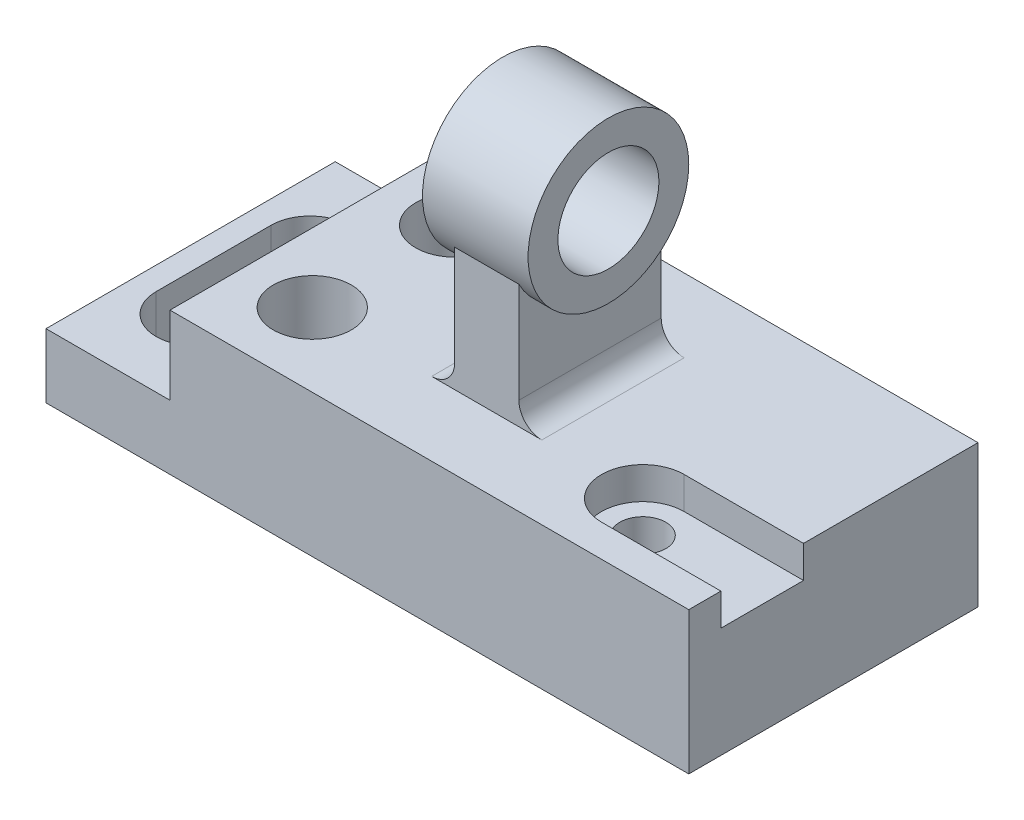
ISO-10303-21;
HEADER;
FILE_DESCRIPTION(('STEP AP214'),'2;1');
FILE_NAME('part.step','',(''),(''),'','','');
FILE_SCHEMA(('AUTOMOTIVE_DESIGN { 1 0 10303 214 1 1 1 1 }'));
ENDSEC;
DATA;
#1=APPLICATION_CONTEXT('core data for automotive mechanical design processes');
#2=APPLICATION_PROTOCOL_DEFINITION('international standard','automotive_design',2000,#1);
#3=PRODUCT_CONTEXT('',#1,'mechanical');
#4=PRODUCT('Part','Part','',(#3));
#5=PRODUCT_RELATED_PRODUCT_CATEGORY('part','',(#4));
#6=PRODUCT_DEFINITION_FORMATION('','',#4);
#7=PRODUCT_DEFINITION_CONTEXT('part definition',#1,'design');
#8=PRODUCT_DEFINITION('design','',#6,#7);
#9=PRODUCT_DEFINITION_SHAPE('','',#8);
#10=(LENGTH_UNIT() NAMED_UNIT(*) SI_UNIT(.MILLI.,.METRE.));
#11=(NAMED_UNIT(*) PLANE_ANGLE_UNIT() SI_UNIT($,.RADIAN.));
#12=(NAMED_UNIT(*) SI_UNIT($,.STERADIAN.) SOLID_ANGLE_UNIT());
#13=UNCERTAINTY_MEASURE_WITH_UNIT(LENGTH_MEASURE(1.E-05),#10,'distance_accuracy_value','');
#14=(GEOMETRIC_REPRESENTATION_CONTEXT(3) GLOBAL_UNCERTAINTY_ASSIGNED_CONTEXT((#13)) GLOBAL_UNIT_ASSIGNED_CONTEXT((#10,
#11,#12)) REPRESENTATION_CONTEXT('',''));
#15=CARTESIAN_POINT('',(0.,0.,0.));
#16=DIRECTION('',(0.,0.,1.));
#17=DIRECTION('',(1.,0.,0.));
#18=AXIS2_PLACEMENT_3D('',#15,#16,#17);
#19=CARTESIAN_POINT('',(67.,0.,-31.5));
#20=DIRECTION('',(0.,1.,0.));
#21=DIRECTION('',(-1.,0.,0.));
#22=AXIS2_PLACEMENT_3D('',#19,#20,#21);
#23=PLANE('',#22);
#24=CARTESIAN_POINT('',(-31.,0.,-15.5));
#25=DIRECTION('',(0.,1.,0.));
#26=DIRECTION('',(-1.,0.,0.));
#27=AXIS2_PLACEMENT_3D('',#24,#25,#26);
#28=CIRCLE('',#27,8.5);
#29=CARTESIAN_POINT('',(-39.5,0.,-15.5));
#30=VERTEX_POINT('',#29);
#31=EDGE_CURVE('E265',#30,#30,#28,.T.);
#32=ORIENTED_EDGE('',*,*,#31,.F.);
#33=EDGE_LOOP('',(#32));
#34=FACE_BOUND('',#33,.T.);
#35=CARTESIAN_POINT('',(-31.,0.,15.5));
#36=DIRECTION('',(0.,1.,0.));
#37=DIRECTION('',(-1.,0.,0.));
#38=AXIS2_PLACEMENT_3D('',#35,#36,#37);
#39=CIRCLE('',#38,8.5);
#40=CARTESIAN_POINT('',(-39.5,0.,15.5));
#41=VERTEX_POINT('',#40);
#42=EDGE_CURVE('E257',#41,#41,#39,.T.);
#43=ORIENTED_EDGE('',*,*,#42,.F.);
#44=EDGE_LOOP('',(#43));
#45=FACE_BOUND('',#44,.T.);
#46=DIRECTION('',(-1.,0.,0.));
#47=VECTOR('',#46,1.);
#48=CARTESIAN_POINT('',(0.,0.,6.50000000000001));
#49=LINE('',#48,#47);
#50=CARTESIAN_POINT('',(67.,0.,6.5));
#51=VERTEX_POINT('',#50);
#52=CARTESIAN_POINT('',(41.,0.,6.5));
#53=VERTEX_POINT('',#52);
#54=EDGE_CURVE('E268',#51,#53,#49,.T.);
#55=ORIENTED_EDGE('',*,*,#54,.F.);
#56=DIRECTION('',(0.,0.,1.));
#57=VECTOR('',#56,1.);
#58=CARTESIAN_POINT('',(67.,0.,-31.5));
#59=LINE('',#58,#57);
#60=CARTESIAN_POINT('',(67.,0.,-31.5));
#61=VERTEX_POINT('',#60);
#62=EDGE_CURVE('E342',#61,#51,#59,.T.);
#63=ORIENTED_EDGE('',*,*,#62,.F.);
#64=DIRECTION('',(-1.,0.,0.));
#65=VECTOR('',#64,1.);
#66=CARTESIAN_POINT('',(67.,0.,-31.5));
#67=LINE('',#66,#65);
#68=CARTESIAN_POINT('',(-46.,0.,-31.5));
#69=VERTEX_POINT('',#68);
#70=EDGE_CURVE('E306',#61,#69,#67,.T.);
#71=ORIENTED_EDGE('',*,*,#70,.T.);
#72=DIRECTION('',(0.,0.,1.));
#73=VECTOR('',#72,1.);
#74=CARTESIAN_POINT('',(-46.,0.,-31.5));
#75=LINE('',#74,#73);
#76=CARTESIAN_POINT('',(-46.,0.,31.5));
#77=VERTEX_POINT('',#76);
#78=EDGE_CURVE('E325',#69,#77,#75,.T.);
#79=ORIENTED_EDGE('',*,*,#78,.T.);
#80=DIRECTION('',(-1.,0.,0.));
#81=VECTOR('',#80,1.);
#82=CARTESIAN_POINT('',(67.,0.,31.5));
#83=LINE('',#82,#81);
#84=CARTESIAN_POINT('',(67.,0.,31.5));
#85=VERTEX_POINT('',#84);
#86=EDGE_CURVE('E305',#85,#77,#83,.T.);
#87=ORIENTED_EDGE('',*,*,#86,.F.);
#88=CARTESIAN_POINT('',(67.,0.,24.5));
#89=VERTEX_POINT('',#88);
#90=EDGE_CURVE('E346',#89,#85,#59,.T.);
#91=ORIENTED_EDGE('',*,*,#90,.F.);
#92=DIRECTION('',(-1.,0.,0.));
#93=VECTOR('',#92,1.);
#94=CARTESIAN_POINT('',(0.,0.,24.5));
#95=LINE('',#94,#93);
#96=CARTESIAN_POINT('',(41.,0.,24.5));
#97=VERTEX_POINT('',#96);
#98=EDGE_CURVE('E275',#89,#97,#95,.T.);
#99=ORIENTED_EDGE('',*,*,#98,.T.);
#100=CARTESIAN_POINT('',(41.,0.,15.5));
#101=DIRECTION('',(0.,1.,0.));
#102=DIRECTION('',(-1.,0.,0.));
#103=AXIS2_PLACEMENT_3D('',#100,#101,#102);
#104=CIRCLE('',#103,9.00000000000001);
#105=EDGE_CURVE('E289',#53,#97,#104,.T.);
#106=ORIENTED_EDGE('',*,*,#105,.F.);
#107=EDGE_LOOP('',(#55,#63,#71,#79,#87,#91,#99,#106));
#108=FACE_BOUND('',#107,.T.);
#109=DIRECTION('',(1.,0.,0.));
#110=VECTOR('',#109,1.);
#111=CARTESIAN_POINT('',(0.,0.,-15.5));
#112=LINE('',#111,#110);
#113=CARTESIAN_POINT('',(-5.,0.,-15.5));
#114=VERTEX_POINT('',#113);
#115=CARTESIAN_POINT('',(19.,0.,-15.5));
#116=VERTEX_POINT('',#115);
#117=EDGE_CURVE('E207',#114,#116,#112,.T.);
#118=ORIENTED_EDGE('',*,*,#117,.T.);
#119=DIRECTION('',(0.,0.,-1.));
#120=VECTOR('',#119,1.);
#121=CARTESIAN_POINT('',(19.,0.,15.5));
#122=LINE('',#121,#120);
#123=CARTESIAN_POINT('',(19.,0.,15.5));
#124=VERTEX_POINT('',#123);
#125=EDGE_CURVE('E373',#116,#124,#122,.F.);
#126=ORIENTED_EDGE('',*,*,#125,.T.);
#127=DIRECTION('',(1.,0.,0.));
#128=VECTOR('',#127,1.);
#129=CARTESIAN_POINT('',(0.,0.,15.5));
#130=LINE('',#129,#128);
#131=CARTESIAN_POINT('',(-5.,0.,15.5));
#132=VERTEX_POINT('',#131);
#133=EDGE_CURVE('E225',#132,#124,#130,.T.);
#134=ORIENTED_EDGE('',*,*,#133,.F.);
#135=DIRECTION('',(0.,0.,-1.));
#136=VECTOR('',#135,1.);
#137=CARTESIAN_POINT('',(-5.,0.,-31.5));
#138=LINE('',#137,#136);
#139=EDGE_CURVE('E370',#132,#114,#138,.T.);
#140=ORIENTED_EDGE('',*,*,#139,.T.);
#141=EDGE_LOOP('',(#118,#126,#134,#140));
#142=FACE_BOUND('',#141,.T.);
#143=ADVANCED_FACE('F49',(#34,#45,#108,#142),#23,.T.);
#144=CARTESIAN_POINT('',(-31.,-31.,15.5));
#145=DIRECTION('',(0.,1.,0.));
#146=DIRECTION('',(-1.,0.,0.));
#147=AXIS2_PLACEMENT_3D('',#144,#145,#146);
#148=CYLINDRICAL_SURFACE('',#147,8.5);
#149=ORIENTED_EDGE('',*,*,#42,.T.);
#150=EDGE_LOOP('',(#149));
#151=FACE_BOUND('',#150,.T.);
#152=CARTESIAN_POINT('',(-31.,-17.,15.5));
#153=DIRECTION('',(0.,-1.,0.));
#154=DIRECTION('',(0.,0.,-1.));
#155=AXIS2_PLACEMENT_3D('',#152,#153,#154);
#156=CIRCLE('',#155,8.5);
#157=CARTESIAN_POINT('',(-31.,-17.,7.));
#158=VERTEX_POINT('',#157);
#159=EDGE_CURVE('E244',#158,#158,#156,.F.);
#160=ORIENTED_EDGE('',*,*,#159,.F.);
#161=EDGE_LOOP('',(#160));
#162=FACE_BOUND('',#161,.T.);
#163=ADVANCED_FACE('F401',(#151,#162),#148,.F.);
#164=CARTESIAN_POINT('',(-31.,-31.,-15.5));
#165=DIRECTION('',(0.,1.,0.));
#166=DIRECTION('',(-1.,0.,0.));
#167=AXIS2_PLACEMENT_3D('',#164,#165,#166);
#168=CYLINDRICAL_SURFACE('',#167,8.5);
#169=ORIENTED_EDGE('',*,*,#31,.T.);
#170=EDGE_LOOP('',(#169));
#171=FACE_BOUND('',#170,.T.);
#172=CARTESIAN_POINT('',(-31.,-17.,-15.5));
#173=DIRECTION('',(0.,-1.,0.));
#174=DIRECTION('',(0.,0.,-1.));
#175=AXIS2_PLACEMENT_3D('',#172,#173,#174);
#176=CIRCLE('',#175,8.5);
#177=CARTESIAN_POINT('',(-31.,-17.,-24.));
#178=VERTEX_POINT('',#177);
#179=EDGE_CURVE('E231',#178,#178,#176,.F.);
#180=ORIENTED_EDGE('',*,*,#179,.F.);
#181=EDGE_LOOP('',(#180));
#182=FACE_BOUND('',#181,.T.);
#183=ADVANCED_FACE('F407',(#171,#182),#168,.F.);
#184=CARTESIAN_POINT('',(41.,-31.,15.5));
#185=DIRECTION('',(0.,1.,0.));
#186=DIRECTION('',(-1.,0.,0.));
#187=AXIS2_PLACEMENT_3D('',#184,#185,#186);
#188=CYLINDRICAL_SURFACE('',#187,5.);
#189=CARTESIAN_POINT('',(41.,-31.,15.5));
#190=DIRECTION('',(0.,1.,0.));
#191=DIRECTION('',(-1.,0.,0.));
#192=AXIS2_PLACEMENT_3D('',#189,#190,#191);
#193=CIRCLE('',#192,5.);
#194=CARTESIAN_POINT('',(36.,-31.,15.5));
#195=VERTEX_POINT('',#194);
#196=EDGE_CURVE('E296',#195,#195,#193,.T.);
#197=ORIENTED_EDGE('',*,*,#196,.F.);
#198=EDGE_LOOP('',(#197));
#199=FACE_BOUND('',#198,.T.);
#200=CARTESIAN_POINT('',(41.,-7.,15.5));
#201=DIRECTION('',(0.,1.,0.));
#202=DIRECTION('',(-1.,0.,0.));
#203=AXIS2_PLACEMENT_3D('',#200,#201,#202);
#204=CIRCLE('',#203,5.);
#205=CARTESIAN_POINT('',(36.,-7.,15.5));
#206=VERTEX_POINT('',#205);
#207=EDGE_CURVE('E271',#206,#206,#204,.T.);
#208=ORIENTED_EDGE('',*,*,#207,.T.);
#209=EDGE_LOOP('',(#208));
#210=FACE_BOUND('',#209,.T.);
#211=ADVANCED_FACE('F654',(#199,#210),#188,.F.);
#212=CARTESIAN_POINT('',(67.,-31.,-31.5));
#213=DIRECTION('',(1.,0.,0.));
#214=DIRECTION('',(0.,0.,-1.));
#215=AXIS2_PLACEMENT_3D('',#212,#213,#214);
#216=PLANE('',#215);
#217=DIRECTION('',(0.,1.,0.));
#218=VECTOR('',#217,1.);
#219=CARTESIAN_POINT('',(67.,-7.,6.5));
#220=LINE('',#219,#218);
#221=CARTESIAN_POINT('',(67.,-7.,6.5));
#222=VERTEX_POINT('',#221);
#223=EDGE_CURVE('E294',#222,#51,#220,.T.);
#224=ORIENTED_EDGE('',*,*,#223,.F.);
#225=DIRECTION('',(0.,0.,-1.));
#226=VECTOR('',#225,1.);
#227=CARTESIAN_POINT('',(67.,-7.,0.));
#228=LINE('',#227,#226);
#229=CARTESIAN_POINT('',(67.,-7.,24.5));
#230=VERTEX_POINT('',#229);
#231=EDGE_CURVE('E283',#230,#222,#228,.T.);
#232=ORIENTED_EDGE('',*,*,#231,.F.);
#233=DIRECTION('',(0.,1.,0.));
#234=VECTOR('',#233,1.);
#235=CARTESIAN_POINT('',(67.,-7.,24.5));
#236=LINE('',#235,#234);
#237=EDGE_CURVE('E297',#230,#89,#236,.T.);
#238=ORIENTED_EDGE('',*,*,#237,.T.);
#239=ORIENTED_EDGE('',*,*,#90,.T.);
#240=DIRECTION('',(0.,1.,0.));
#241=VECTOR('',#240,1.);
#242=CARTESIAN_POINT('',(67.,-31.,31.5));
#243=LINE('',#242,#241);
#244=CARTESIAN_POINT('',(67.,-31.,31.5));
#245=VERTEX_POINT('',#244);
#246=EDGE_CURVE('E310',#245,#85,#243,.T.);
#247=ORIENTED_EDGE('',*,*,#246,.F.);
#248=DIRECTION('',(0.,0.,1.));
#249=VECTOR('',#248,1.);
#250=CARTESIAN_POINT('',(67.,-31.,-31.5));
#251=LINE('',#250,#249);
#252=CARTESIAN_POINT('',(67.,-31.,-31.5));
#253=VERTEX_POINT('',#252);
#254=EDGE_CURVE('E347',#253,#245,#251,.T.);
#255=ORIENTED_EDGE('',*,*,#254,.F.);
#256=DIRECTION('',(0.,1.,0.));
#257=VECTOR('',#256,1.);
#258=CARTESIAN_POINT('',(67.,-31.,-31.5));
#259=LINE('',#258,#257);
#260=EDGE_CURVE('E322',#253,#61,#259,.T.);
#261=ORIENTED_EDGE('',*,*,#260,.T.);
#262=ORIENTED_EDGE('',*,*,#62,.T.);
#263=EDGE_LOOP('',(#224,#232,#238,#239,#247,#255,#261,#262));
#264=FACE_BOUND('',#263,.T.);
#265=ADVANCED_FACE('F646',(#264),#216,.T.);
#266=CARTESIAN_POINT('',(-73.,-31.,-31.5));
#267=DIRECTION('',(0.,-1.,0.));
#268=DIRECTION('',(0.,0.,-1.));
#269=AXIS2_PLACEMENT_3D('',#266,#267,#268);
#270=PLANE('',#269);
#271=CARTESIAN_POINT('',(-31.,-31.,15.5));
#272=DIRECTION('',(0.,-1.,0.));
#273=DIRECTION('',(0.,0.,-1.));
#274=AXIS2_PLACEMENT_3D('',#271,#272,#273);
#275=CIRCLE('',#274,12.5);
#276=CARTESIAN_POINT('',(-31.,-31.,3.));
#277=VERTEX_POINT('',#276);
#278=EDGE_CURVE('E232',#277,#277,#275,.T.);
#279=ORIENTED_EDGE('',*,*,#278,.F.);
#280=EDGE_LOOP('',(#279));
#281=FACE_BOUND('',#280,.T.);
#282=CARTESIAN_POINT('',(-31.,-31.,-15.5));
#283=DIRECTION('',(0.,-1.,0.));
#284=DIRECTION('',(0.,0.,-1.));
#285=AXIS2_PLACEMENT_3D('',#282,#283,#284);
#286=CIRCLE('',#285,12.5);
#287=CARTESIAN_POINT('',(-31.,-31.,-28.));
#288=VERTEX_POINT('',#287);
#289=EDGE_CURVE('E206',#288,#288,#286,.T.);
#290=ORIENTED_EDGE('',*,*,#289,.F.);
#291=EDGE_LOOP('',(#290));
#292=FACE_BOUND('',#291,.T.);
#293=DIRECTION('',(0.,0.,1.));
#294=VECTOR('',#293,1.);
#295=CARTESIAN_POINT('',(-68.,-31.,0.));
#296=LINE('',#295,#294);
#297=CARTESIAN_POINT('',(-68.,-31.,-12.5));
#298=VERTEX_POINT('',#297);
#299=CARTESIAN_POINT('',(-68.,-31.,12.5));
#300=VERTEX_POINT('',#299);
#301=EDGE_CURVE('E240',#298,#300,#296,.T.);
#302=ORIENTED_EDGE('',*,*,#301,.T.);
#303=CARTESIAN_POINT('',(-59.5,-31.,12.5));
#304=DIRECTION('',(0.,1.,0.));
#305=DIRECTION('',(-1.,0.,0.));
#306=AXIS2_PLACEMENT_3D('',#303,#304,#305);
#307=CIRCLE('',#306,8.50000000000001);
#308=CARTESIAN_POINT('',(-51.,-31.,12.5));
#309=VERTEX_POINT('',#308);
#310=EDGE_CURVE('E243',#300,#309,#307,.T.);
#311=ORIENTED_EDGE('',*,*,#310,.T.);
#312=DIRECTION('',(0.,0.,1.));
#313=VECTOR('',#312,1.);
#314=CARTESIAN_POINT('',(-51.,-31.,0.));
#315=LINE('',#314,#313);
#316=CARTESIAN_POINT('',(-51.,-31.,-12.5));
#317=VERTEX_POINT('',#316);
#318=EDGE_CURVE('E247',#317,#309,#315,.T.);
#319=ORIENTED_EDGE('',*,*,#318,.F.);
#320=CARTESIAN_POINT('',(-59.5,-31.,-12.5));
#321=DIRECTION('',(0.,1.,0.));
#322=DIRECTION('',(-1.,0.,0.));
#323=AXIS2_PLACEMENT_3D('',#320,#321,#322);
#324=CIRCLE('',#323,8.50000000000001);
#325=EDGE_CURVE('E250',#317,#298,#324,.T.);
#326=ORIENTED_EDGE('',*,*,#325,.T.);
#327=EDGE_LOOP('',(#302,#311,#319,#326));
#328=FACE_BOUND('',#327,.T.);
#329=ORIENTED_EDGE('',*,*,#196,.T.);
#330=EDGE_LOOP('',(#329));
#331=FACE_BOUND('',#330,.T.);
#332=DIRECTION('',(1.,0.,0.));
#333=VECTOR('',#332,1.);
#334=CARTESIAN_POINT('',(-73.,-31.,31.5));
#335=LINE('',#334,#333);
#336=CARTESIAN_POINT('',(-73.,-31.,31.5));
#337=VERTEX_POINT('',#336);
#338=EDGE_CURVE('E337',#337,#245,#335,.T.);
#339=ORIENTED_EDGE('',*,*,#338,.F.);
#340=DIRECTION('',(0.,0.,1.));
#341=VECTOR('',#340,1.);
#342=CARTESIAN_POINT('',(-73.,-31.,-31.5));
#343=LINE('',#342,#341);
#344=CARTESIAN_POINT('',(-73.,-31.,-31.5));
#345=VERTEX_POINT('',#344);
#346=EDGE_CURVE('E349',#345,#337,#343,.T.);
#347=ORIENTED_EDGE('',*,*,#346,.F.);
#348=DIRECTION('',(1.,0.,0.));
#349=VECTOR('',#348,1.);
#350=CARTESIAN_POINT('',(-73.,-31.,-31.5));
#351=LINE('',#350,#349);
#352=EDGE_CURVE('E319',#345,#253,#351,.T.);
#353=ORIENTED_EDGE('',*,*,#352,.T.);
#354=ORIENTED_EDGE('',*,*,#254,.T.);
#355=EDGE_LOOP('',(#339,#347,#353,#354));
#356=FACE_BOUND('',#355,.T.);
#357=ADVANCED_FACE('F639',(#281,#292,#328,#331,#356),#270,.T.);
#358=CARTESIAN_POINT('',(-73.,-17.,-31.5));
#359=DIRECTION('',(-1.,0.,0.));
#360=DIRECTION('',(0.,0.,1.));
#361=AXIS2_PLACEMENT_3D('',#358,#359,#360);
#362=PLANE('',#361);
#363=DIRECTION('',(0.,-1.,0.));
#364=VECTOR('',#363,1.);
#365=CARTESIAN_POINT('',(-73.,-17.,31.5));
#366=LINE('',#365,#364);
#367=CARTESIAN_POINT('',(-73.,-17.,31.5));
#368=VERTEX_POINT('',#367);
#369=EDGE_CURVE('E334',#368,#337,#366,.T.);
#370=ORIENTED_EDGE('',*,*,#369,.F.);
#371=DIRECTION('',(0.,0.,1.));
#372=VECTOR('',#371,1.);
#373=CARTESIAN_POINT('',(-73.,-17.,-31.5));
#374=LINE('',#373,#372);
#375=CARTESIAN_POINT('',(-73.,-17.,-31.5));
#376=VERTEX_POINT('',#375);
#377=EDGE_CURVE('E351',#376,#368,#374,.T.);
#378=ORIENTED_EDGE('',*,*,#377,.F.);
#379=DIRECTION('',(0.,-1.,0.));
#380=VECTOR('',#379,1.);
#381=CARTESIAN_POINT('',(-73.,-17.,-31.5));
#382=LINE('',#381,#380);
#383=EDGE_CURVE('E316',#376,#345,#382,.T.);
#384=ORIENTED_EDGE('',*,*,#383,.T.);
#385=ORIENTED_EDGE('',*,*,#346,.T.);
#386=EDGE_LOOP('',(#370,#378,#384,#385));
#387=FACE_BOUND('',#386,.T.);
#388=ADVANCED_FACE('F633',(#387),#362,.T.);
#389=CARTESIAN_POINT('',(-46.,-17.,-31.5));
#390=DIRECTION('',(0.,1.,0.));
#391=DIRECTION('',(0.,0.,1.));
#392=AXIS2_PLACEMENT_3D('',#389,#390,#391);
#393=PLANE('',#392);
#394=DIRECTION('',(0.,0.,1.));
#395=VECTOR('',#394,1.);
#396=CARTESIAN_POINT('',(-68.,-17.,-31.5));
#397=LINE('',#396,#395);
#398=CARTESIAN_POINT('',(-68.,-17.,-12.5));
#399=VERTEX_POINT('',#398);
#400=CARTESIAN_POINT('',(-68.,-17.,12.5));
#401=VERTEX_POINT('',#400);
#402=EDGE_CURVE('E362',#399,#401,#397,.T.);
#403=ORIENTED_EDGE('',*,*,#402,.F.);
#404=CARTESIAN_POINT('',(-59.5,-17.,-12.5));
#405=DIRECTION('',(0.,1.,0.));
#406=DIRECTION('',(0.,0.,1.));
#407=AXIS2_PLACEMENT_3D('',#404,#405,#406);
#408=CIRCLE('',#407,8.50000000000001);
#409=CARTESIAN_POINT('',(-51.,-17.,-12.5));
#410=VERTEX_POINT('',#409);
#411=EDGE_CURVE('E360',#410,#399,#408,.T.);
#412=ORIENTED_EDGE('',*,*,#411,.F.);
#413=DIRECTION('',(0.,0.,1.));
#414=VECTOR('',#413,1.);
#415=CARTESIAN_POINT('',(-51.,-17.,-31.5));
#416=LINE('',#415,#414);
#417=CARTESIAN_POINT('',(-51.,-17.,12.5));
#418=VERTEX_POINT('',#417);
#419=EDGE_CURVE('E357',#410,#418,#416,.T.);
#420=ORIENTED_EDGE('',*,*,#419,.T.);
#421=CARTESIAN_POINT('',(-59.5,-17.,12.5));
#422=DIRECTION('',(0.,1.,0.));
#423=DIRECTION('',(0.,0.,1.));
#424=AXIS2_PLACEMENT_3D('',#421,#422,#423);
#425=CIRCLE('',#424,8.50000000000001);
#426=EDGE_CURVE('E345',#401,#418,#425,.T.);
#427=ORIENTED_EDGE('',*,*,#426,.F.);
#428=EDGE_LOOP('',(#403,#412,#420,#427));
#429=FACE_BOUND('',#428,.T.);
#430=DIRECTION('',(-1.,0.,0.));
#431=VECTOR('',#430,1.);
#432=CARTESIAN_POINT('',(-46.,-17.,31.5));
#433=LINE('',#432,#431);
#434=CARTESIAN_POINT('',(-46.,-17.,31.5));
#435=VERTEX_POINT('',#434);
#436=EDGE_CURVE('E331',#435,#368,#433,.T.);
#437=ORIENTED_EDGE('',*,*,#436,.F.);
#438=DIRECTION('',(0.,0.,1.));
#439=VECTOR('',#438,1.);
#440=CARTESIAN_POINT('',(-46.,-17.,-31.5));
#441=LINE('',#440,#439);
#442=CARTESIAN_POINT('',(-46.,-17.,-31.5));
#443=VERTEX_POINT('',#442);
#444=EDGE_CURVE('E353',#443,#435,#441,.T.);
#445=ORIENTED_EDGE('',*,*,#444,.F.);
#446=DIRECTION('',(-1.,0.,0.));
#447=VECTOR('',#446,1.);
#448=CARTESIAN_POINT('',(-46.,-17.,-31.5));
#449=LINE('',#448,#447);
#450=EDGE_CURVE('E313',#443,#376,#449,.T.);
#451=ORIENTED_EDGE('',*,*,#450,.T.);
#452=ORIENTED_EDGE('',*,*,#377,.T.);
#453=EDGE_LOOP('',(#437,#445,#451,#452));
#454=FACE_BOUND('',#453,.T.);
#455=ADVANCED_FACE('F626',(#429,#454),#393,.T.);
#456=CARTESIAN_POINT('',(-46.,0.,-31.5));
#457=DIRECTION('',(-1.,0.,0.));
#458=DIRECTION('',(0.,0.,1.));
#459=AXIS2_PLACEMENT_3D('',#456,#457,#458);
#460=PLANE('',#459);
#461=DIRECTION('',(0.,-1.,0.));
#462=VECTOR('',#461,1.);
#463=CARTESIAN_POINT('',(-46.,0.,31.5));
#464=LINE('',#463,#462);
#465=EDGE_CURVE('E328',#77,#435,#464,.T.);
#466=ORIENTED_EDGE('',*,*,#465,.F.);
#467=ORIENTED_EDGE('',*,*,#78,.F.);
#468=DIRECTION('',(0.,-1.,0.));
#469=VECTOR('',#468,1.);
#470=CARTESIAN_POINT('',(-46.,0.,-31.5));
#471=LINE('',#470,#469);
#472=EDGE_CURVE('E309',#69,#443,#471,.T.);
#473=ORIENTED_EDGE('',*,*,#472,.T.);
#474=ORIENTED_EDGE('',*,*,#444,.T.);
#475=EDGE_LOOP('',(#466,#467,#473,#474));
#476=FACE_BOUND('',#475,.T.);
#477=ADVANCED_FACE('F413',(#476),#460,.T.);
#478=CARTESIAN_POINT('',(0.,0.,-31.5));
#479=DIRECTION('',(0.,0.,1.));
#480=DIRECTION('',(1.,0.,0.));
#481=AXIS2_PLACEMENT_3D('',#478,#479,#480);
#482=PLANE('',#481);
#483=ORIENTED_EDGE('',*,*,#70,.F.);
#484=ORIENTED_EDGE('',*,*,#260,.F.);
#485=ORIENTED_EDGE('',*,*,#352,.F.);
#486=ORIENTED_EDGE('',*,*,#383,.F.);
#487=ORIENTED_EDGE('',*,*,#450,.F.);
#488=ORIENTED_EDGE('',*,*,#472,.F.);
#489=EDGE_LOOP('',(#483,#484,#485,#486,#487,#488));
#490=FACE_BOUND('',#489,.T.);
#491=ADVANCED_FACE('F610',(#490),#482,.F.);
#492=CARTESIAN_POINT('',(0.,0.,31.5));
#493=DIRECTION('',(0.,0.,1.));
#494=DIRECTION('',(1.,0.,0.));
#495=AXIS2_PLACEMENT_3D('',#492,#493,#494);
#496=PLANE('',#495);
#497=ORIENTED_EDGE('',*,*,#86,.T.);
#498=ORIENTED_EDGE('',*,*,#465,.T.);
#499=ORIENTED_EDGE('',*,*,#436,.T.);
#500=ORIENTED_EDGE('',*,*,#369,.T.);
#501=ORIENTED_EDGE('',*,*,#338,.T.);
#502=ORIENTED_EDGE('',*,*,#246,.T.);
#503=EDGE_LOOP('',(#497,#498,#499,#500,#501,#502));
#504=FACE_BOUND('',#503,.T.);
#505=ADVANCED_FACE('F601',(#504),#496,.T.);
#506=CARTESIAN_POINT('',(0.,-7.,6.50000000000001));
#507=DIRECTION('',(0.,0.,-1.));
#508=DIRECTION('',(-1.,0.,0.));
#509=AXIS2_PLACEMENT_3D('',#506,#507,#508);
#510=PLANE('',#509);
#511=ORIENTED_EDGE('',*,*,#54,.T.);
#512=DIRECTION('',(0.,1.,0.));
#513=VECTOR('',#512,1.);
#514=CARTESIAN_POINT('',(41.,-7.,6.5));
#515=LINE('',#514,#513);
#516=CARTESIAN_POINT('',(41.,-7.,6.5));
#517=VERTEX_POINT('',#516);
#518=EDGE_CURVE('E286',#517,#53,#515,.T.);
#519=ORIENTED_EDGE('',*,*,#518,.F.);
#520=DIRECTION('',(-1.,0.,0.));
#521=VECTOR('',#520,1.);
#522=CARTESIAN_POINT('',(0.,-7.,6.50000000000001));
#523=LINE('',#522,#521);
#524=EDGE_CURVE('E274',#222,#517,#523,.T.);
#525=ORIENTED_EDGE('',*,*,#524,.F.);
#526=ORIENTED_EDGE('',*,*,#223,.T.);
#527=EDGE_LOOP('',(#511,#519,#525,#526));
#528=FACE_BOUND('',#527,.T.);
#529=ADVANCED_FACE('F593',(#528),#510,.F.);
#530=CARTESIAN_POINT('',(0.,-7.,24.5));
#531=DIRECTION('',(0.,0.,-1.));
#532=DIRECTION('',(-1.,0.,0.));
#533=AXIS2_PLACEMENT_3D('',#530,#531,#532);
#534=PLANE('',#533);
#535=ORIENTED_EDGE('',*,*,#98,.F.);
#536=ORIENTED_EDGE('',*,*,#237,.F.);
#537=DIRECTION('',(-1.,0.,0.));
#538=VECTOR('',#537,1.);
#539=CARTESIAN_POINT('',(0.,-7.,24.5));
#540=LINE('',#539,#538);
#541=CARTESIAN_POINT('',(41.,-7.,24.5));
#542=VERTEX_POINT('',#541);
#543=EDGE_CURVE('E281',#230,#542,#540,.T.);
#544=ORIENTED_EDGE('',*,*,#543,.T.);
#545=DIRECTION('',(0.,1.,0.));
#546=VECTOR('',#545,1.);
#547=CARTESIAN_POINT('',(41.,-7.,24.5));
#548=LINE('',#547,#546);
#549=EDGE_CURVE('E300',#542,#97,#548,.T.);
#550=ORIENTED_EDGE('',*,*,#549,.T.);
#551=EDGE_LOOP('',(#535,#536,#544,#550));
#552=FACE_BOUND('',#551,.T.);
#553=ADVANCED_FACE('F585',(#552),#534,.T.);
#554=CARTESIAN_POINT('',(41.,-7.,15.5));
#555=DIRECTION('',(0.,1.,0.));
#556=DIRECTION('',(-1.,0.,0.));
#557=AXIS2_PLACEMENT_3D('',#554,#555,#556);
#558=CYLINDRICAL_SURFACE('',#557,9.00000000000001);
#559=ORIENTED_EDGE('',*,*,#105,.T.);
#560=ORIENTED_EDGE('',*,*,#549,.F.);
#561=CARTESIAN_POINT('',(41.,-7.,15.5));
#562=DIRECTION('',(0.,1.,0.));
#563=DIRECTION('',(-1.,0.,0.));
#564=AXIS2_PLACEMENT_3D('',#561,#562,#563);
#565=CIRCLE('',#564,9.00000000000001);
#566=EDGE_CURVE('E278',#517,#542,#565,.T.);
#567=ORIENTED_EDGE('',*,*,#566,.F.);
#568=ORIENTED_EDGE('',*,*,#518,.T.);
#569=EDGE_LOOP('',(#559,#560,#567,#568));
#570=FACE_BOUND('',#569,.T.);
#571=ADVANCED_FACE('F577',(#570),#558,.F.);
#572=CARTESIAN_POINT('',(0.,-7.,0.));
#573=DIRECTION('',(0.,1.,0.));
#574=DIRECTION('',(-1.,0.,0.));
#575=AXIS2_PLACEMENT_3D('',#572,#573,#574);
#576=PLANE('',#575);
#577=ORIENTED_EDGE('',*,*,#207,.F.);
#578=EDGE_LOOP('',(#577));
#579=FACE_BOUND('',#578,.T.);
#580=ORIENTED_EDGE('',*,*,#524,.T.);
#581=ORIENTED_EDGE('',*,*,#566,.T.);
#582=ORIENTED_EDGE('',*,*,#543,.F.);
#583=ORIENTED_EDGE('',*,*,#231,.T.);
#584=EDGE_LOOP('',(#580,#581,#582,#583));
#585=FACE_BOUND('',#584,.T.);
#586=ADVANCED_FACE('F568',(#579,#585),#576,.T.);
#587=CARTESIAN_POINT('',(-68.,-31.,0.));
#588=DIRECTION('',(-1.,0.,0.));
#589=DIRECTION('',(0.,-1.,0.));
#590=AXIS2_PLACEMENT_3D('',#587,#588,#589);
#591=PLANE('',#590);
#592=ORIENTED_EDGE('',*,*,#402,.T.);
#593=DIRECTION('',(0.,1.,0.));
#594=VECTOR('',#593,1.);
#595=CARTESIAN_POINT('',(-68.,-31.,12.5));
#596=LINE('',#595,#594);
#597=EDGE_CURVE('E253',#300,#401,#596,.T.);
#598=ORIENTED_EDGE('',*,*,#597,.F.);
#599=ORIENTED_EDGE('',*,*,#301,.F.);
#600=DIRECTION('',(0.,1.,0.));
#601=VECTOR('',#600,1.);
#602=CARTESIAN_POINT('',(-68.,-31.,-12.5));
#603=LINE('',#602,#601);
#604=EDGE_CURVE('E254',#298,#399,#603,.T.);
#605=ORIENTED_EDGE('',*,*,#604,.T.);
#606=EDGE_LOOP('',(#592,#598,#599,#605));
#607=FACE_BOUND('',#606,.T.);
#608=ADVANCED_FACE('F560',(#607),#591,.F.);
#609=CARTESIAN_POINT('',(-59.5,-31.,-12.5));
#610=DIRECTION('',(0.,1.,0.));
#611=DIRECTION('',(-1.,0.,0.));
#612=AXIS2_PLACEMENT_3D('',#609,#610,#611);
#613=CYLINDRICAL_SURFACE('',#612,8.50000000000001);
#614=ORIENTED_EDGE('',*,*,#411,.T.);
#615=ORIENTED_EDGE('',*,*,#604,.F.);
#616=ORIENTED_EDGE('',*,*,#325,.F.);
#617=DIRECTION('',(0.,1.,0.));
#618=VECTOR('',#617,1.);
#619=CARTESIAN_POINT('',(-51.,-31.,-12.5));
#620=LINE('',#619,#618);
#621=EDGE_CURVE('E258',#317,#410,#620,.T.);
#622=ORIENTED_EDGE('',*,*,#621,.T.);
#623=EDGE_LOOP('',(#614,#615,#616,#622));
#624=FACE_BOUND('',#623,.T.);
#625=ADVANCED_FACE('F552',(#624),#613,.F.);
#626=CARTESIAN_POINT('',(-51.,-31.,0.));
#627=DIRECTION('',(-1.,0.,0.));
#628=DIRECTION('',(0.,-1.,0.));
#629=AXIS2_PLACEMENT_3D('',#626,#627,#628);
#630=PLANE('',#629);
#631=ORIENTED_EDGE('',*,*,#621,.F.);
#632=ORIENTED_EDGE('',*,*,#318,.T.);
#633=DIRECTION('',(0.,1.,0.));
#634=VECTOR('',#633,1.);
#635=CARTESIAN_POINT('',(-51.,-31.,12.5));
#636=LINE('',#635,#634);
#637=EDGE_CURVE('E261',#309,#418,#636,.T.);
#638=ORIENTED_EDGE('',*,*,#637,.T.);
#639=ORIENTED_EDGE('',*,*,#419,.F.);
#640=EDGE_LOOP('',(#631,#632,#638,#639));
#641=FACE_BOUND('',#640,.T.);
#642=ADVANCED_FACE('F543',(#641),#630,.T.);
#643=CARTESIAN_POINT('',(-59.5,-31.,12.5));
#644=DIRECTION('',(0.,1.,0.));
#645=DIRECTION('',(-1.,0.,0.));
#646=AXIS2_PLACEMENT_3D('',#643,#644,#645);
#647=CYLINDRICAL_SURFACE('',#646,8.50000000000001);
#648=ORIENTED_EDGE('',*,*,#426,.T.);
#649=ORIENTED_EDGE('',*,*,#637,.F.);
#650=ORIENTED_EDGE('',*,*,#310,.F.);
#651=ORIENTED_EDGE('',*,*,#597,.T.);
#652=EDGE_LOOP('',(#648,#649,#650,#651));
#653=FACE_BOUND('',#652,.T.);
#654=ADVANCED_FACE('F534',(#653),#647,.F.);
#655=CARTESIAN_POINT('',(-31.,-17.,-15.5));
#656=DIRECTION('',(0.,-1.,0.));
#657=DIRECTION('',(0.,0.,-1.));
#658=AXIS2_PLACEMENT_3D('',#655,#656,#657);
#659=PLANE('',#658);
#660=CARTESIAN_POINT('',(-31.,-17.,-15.5));
#661=DIRECTION('',(0.,-1.,0.));
#662=DIRECTION('',(0.,0.,-1.));
#663=AXIS2_PLACEMENT_3D('',#660,#661,#662);
#664=CIRCLE('',#663,12.5);
#665=CARTESIAN_POINT('',(-31.,-17.,-28.));
#666=VERTEX_POINT('',#665);
#667=EDGE_CURVE('E235',#666,#666,#664,.T.);
#668=ORIENTED_EDGE('',*,*,#667,.T.);
#669=EDGE_LOOP('',(#668));
#670=FACE_BOUND('',#669,.T.);
#671=ORIENTED_EDGE('',*,*,#179,.T.);
#672=EDGE_LOOP('',(#671));
#673=FACE_BOUND('',#672,.T.);
#674=ADVANCED_FACE('F526',(#670,#673),#659,.T.);
#675=CARTESIAN_POINT('',(-31.,-17.,-15.5));
#676=DIRECTION('',(0.,-1.,0.));
#677=DIRECTION('',(0.,0.,-1.));
#678=AXIS2_PLACEMENT_3D('',#675,#676,#677);
#679=CYLINDRICAL_SURFACE('',#678,12.5);
#680=ORIENTED_EDGE('',*,*,#667,.F.);
#681=EDGE_LOOP('',(#680));
#682=FACE_BOUND('',#681,.T.);
#683=ORIENTED_EDGE('',*,*,#289,.T.);
#684=EDGE_LOOP('',(#683));
#685=FACE_BOUND('',#684,.T.);
#686=ADVANCED_FACE('F518',(#682,#685),#679,.F.);
#687=CARTESIAN_POINT('',(-31.,-17.,15.5));
#688=DIRECTION('',(0.,-1.,0.));
#689=DIRECTION('',(0.,0.,-1.));
#690=AXIS2_PLACEMENT_3D('',#687,#688,#689);
#691=PLANE('',#690);
#692=CARTESIAN_POINT('',(-31.,-17.,15.5));
#693=DIRECTION('',(0.,-1.,0.));
#694=DIRECTION('',(0.,0.,-1.));
#695=AXIS2_PLACEMENT_3D('',#692,#693,#694);
#696=CIRCLE('',#695,12.5);
#697=CARTESIAN_POINT('',(-31.,-17.,3.));
#698=VERTEX_POINT('',#697);
#699=EDGE_CURVE('E228',#698,#698,#696,.T.);
#700=ORIENTED_EDGE('',*,*,#699,.T.);
#701=EDGE_LOOP('',(#700));
#702=FACE_BOUND('',#701,.T.);
#703=ORIENTED_EDGE('',*,*,#159,.T.);
#704=EDGE_LOOP('',(#703));
#705=FACE_BOUND('',#704,.T.);
#706=ADVANCED_FACE('F511',(#702,#705),#691,.T.);
#707=CARTESIAN_POINT('',(-31.,-17.,15.5));
#708=DIRECTION('',(0.,-1.,0.));
#709=DIRECTION('',(0.,0.,-1.));
#710=AXIS2_PLACEMENT_3D('',#707,#708,#709);
#711=CYLINDRICAL_SURFACE('',#710,12.5);
#712=ORIENTED_EDGE('',*,*,#699,.F.);
#713=EDGE_LOOP('',(#712));
#714=FACE_BOUND('',#713,.T.);
#715=ORIENTED_EDGE('',*,*,#278,.T.);
#716=EDGE_LOOP('',(#715));
#717=FACE_BOUND('',#716,.T.);
#718=ADVANCED_FACE('F478',(#714,#717),#711,.F.);
#719=CARTESIAN_POINT('',(0.,0.,-15.5));
#720=DIRECTION('',(0.,0.,-1.));
#721=DIRECTION('',(-1.,0.,0.));
#722=AXIS2_PLACEMENT_3D('',#719,#720,#721);
#723=PLANE('',#722);
#724=DIRECTION('',(1.,0.,0.));
#725=VECTOR('',#724,1.);
#726=CARTESIAN_POINT('',(0.,26.875961595364,-15.5));
#727=LINE('',#726,#725);
#728=CARTESIAN_POINT('',(0.,26.875961595364,-15.5));
#729=VERTEX_POINT('',#728);
#730=CARTESIAN_POINT('',(14.,26.875961595364,-15.5));
#731=VERTEX_POINT('',#730);
#732=EDGE_CURVE('E200',#729,#731,#727,.T.);
#733=ORIENTED_EDGE('',*,*,#732,.T.);
#734=DIRECTION('',(0.,1.,0.));
#735=VECTOR('',#734,1.);
#736=CARTESIAN_POINT('',(14.,0.,-15.5));
#737=LINE('',#736,#735);
#738=CARTESIAN_POINT('',(14.,5.,-15.5));
#739=VERTEX_POINT('',#738);
#740=EDGE_CURVE('E186',#739,#731,#737,.T.);
#741=ORIENTED_EDGE('',*,*,#740,.F.);
#742=CARTESIAN_POINT('',(19.,5.,-15.5));
#743=DIRECTION('',(0.,0.,-1.));
#744=DIRECTION('',(-1.,0.,0.));
#745=AXIS2_PLACEMENT_3D('',#742,#743,#744);
#746=CIRCLE('',#745,5.);
#747=EDGE_CURVE('E377',#739,#116,#746,.F.);
#748=ORIENTED_EDGE('',*,*,#747,.T.);
#749=ORIENTED_EDGE('',*,*,#117,.F.);
#750=CARTESIAN_POINT('',(-5.,5.,-15.5));
#751=DIRECTION('',(0.,0.,-1.));
#752=DIRECTION('',(-1.,0.,0.));
#753=AXIS2_PLACEMENT_3D('',#750,#751,#752);
#754=CIRCLE('',#753,5.);
#755=CARTESIAN_POINT('',(0.,5.,-15.5));
#756=VERTEX_POINT('',#755);
#757=EDGE_CURVE('E57',#114,#756,#754,.F.);
#758=ORIENTED_EDGE('',*,*,#757,.T.);
#759=DIRECTION('',(0.,1.,0.));
#760=VECTOR('',#759,1.);
#761=CARTESIAN_POINT('',(0.,0.,-15.5));
#762=LINE('',#761,#760);
#763=EDGE_CURVE('E202',#756,#729,#762,.T.);
#764=ORIENTED_EDGE('',*,*,#763,.T.);
#765=EDGE_LOOP('',(#733,#741,#748,#749,#758,#764));
#766=FACE_BOUND('',#765,.T.);
#767=ADVANCED_FACE('F201',(#766),#723,.T.);
#768=CARTESIAN_POINT('',(0.,0.,15.5));
#769=DIRECTION('',(0.,0.,-1.));
#770=DIRECTION('',(0.,1.,0.));
#771=AXIS2_PLACEMENT_3D('',#768,#769,#770);
#772=PLANE('',#771);
#773=ORIENTED_EDGE('',*,*,#133,.T.);
#774=CARTESIAN_POINT('',(19.,5.,15.5));
#775=DIRECTION('',(0.,0.,-1.));
#776=DIRECTION('',(0.,1.,0.));
#777=AXIS2_PLACEMENT_3D('',#774,#775,#776);
#778=CIRCLE('',#777,5.);
#779=CARTESIAN_POINT('',(14.,5.,15.5));
#780=VERTEX_POINT('',#779);
#781=EDGE_CURVE('E379',#124,#780,#778,.T.);
#782=ORIENTED_EDGE('',*,*,#781,.T.);
#783=DIRECTION('',(0.,1.,0.));
#784=VECTOR('',#783,1.);
#785=CARTESIAN_POINT('',(14.,0.,15.5));
#786=LINE('',#785,#784);
#787=CARTESIAN_POINT('',(14.,26.875961595364,15.5));
#788=VERTEX_POINT('',#787);
#789=EDGE_CURVE('E197',#780,#788,#786,.T.);
#790=ORIENTED_EDGE('',*,*,#789,.T.);
#791=DIRECTION('',(1.,0.,0.));
#792=VECTOR('',#791,1.);
#793=CARTESIAN_POINT('',(0.,26.875961595364,15.5));
#794=LINE('',#793,#792);
#795=CARTESIAN_POINT('',(0.,26.875961595364,15.5));
#796=VERTEX_POINT('',#795);
#797=EDGE_CURVE('E211',#796,#788,#794,.T.);
#798=ORIENTED_EDGE('',*,*,#797,.F.);
#799=DIRECTION('',(0.,1.,0.));
#800=VECTOR('',#799,1.);
#801=CARTESIAN_POINT('',(0.,0.,15.5));
#802=LINE('',#801,#800);
#803=CARTESIAN_POINT('',(0.,5.,15.5));
#804=VERTEX_POINT('',#803);
#805=EDGE_CURVE('E221',#804,#796,#802,.T.);
#806=ORIENTED_EDGE('',*,*,#805,.F.);
#807=CARTESIAN_POINT('',(-5.,5.,15.5));
#808=DIRECTION('',(0.,0.,-1.));
#809=DIRECTION('',(0.,1.,0.));
#810=AXIS2_PLACEMENT_3D('',#807,#808,#809);
#811=CIRCLE('',#810,5.);
#812=EDGE_CURVE('E13',#804,#132,#811,.T.);
#813=ORIENTED_EDGE('',*,*,#812,.T.);
#814=EDGE_LOOP('',(#773,#782,#790,#798,#806,#813));
#815=FACE_BOUND('',#814,.T.);
#816=ADVANCED_FACE('F382',(#815),#772,.F.);
#817=CARTESIAN_POINT('',(0.,0.,0.));
#818=DIRECTION('',(1.,0.,0.));
#819=DIRECTION('',(0.,0.,-1.));
#820=AXIS2_PLACEMENT_3D('',#817,#818,#819);
#821=PLANE('',#820);
#822=ORIENTED_EDGE('',*,*,#763,.F.);
#823=DIRECTION('',(0.,0.,-1.));
#824=VECTOR('',#823,1.);
#825=CARTESIAN_POINT('',(0.,5.,0.));
#826=LINE('',#825,#824);
#827=EDGE_CURVE('E64',#756,#804,#826,.F.);
#828=ORIENTED_EDGE('',*,*,#827,.T.);
#829=ORIENTED_EDGE('',*,*,#805,.T.);
#830=CARTESIAN_POINT('',(0.,35.,0.));
#831=DIRECTION('',(1.,0.,0.));
#832=DIRECTION('',(0.,0.,-1.));
#833=AXIS2_PLACEMENT_3D('',#830,#831,#832);
#834=CIRCLE('',#833,17.5);
#835=EDGE_CURVE('E196',#796,#729,#834,.T.);
#836=ORIENTED_EDGE('',*,*,#835,.T.);
#837=EDGE_LOOP('',(#822,#828,#829,#836));
#838=FACE_BOUND('',#837,.T.);
#839=ADVANCED_FACE('F390',(#838),#821,.F.);
#840=CARTESIAN_POINT('',(14.,0.,0.));
#841=DIRECTION('',(1.,0.,0.));
#842=DIRECTION('',(0.,0.,-1.));
#843=AXIS2_PLACEMENT_3D('',#840,#841,#842);
#844=PLANE('',#843);
#845=ORIENTED_EDGE('',*,*,#789,.F.);
#846=DIRECTION('',(0.,0.,-1.));
#847=VECTOR('',#846,1.);
#848=CARTESIAN_POINT('',(14.,5.,-15.5));
#849=LINE('',#848,#847);
#850=EDGE_CURVE('E194',#780,#739,#849,.T.);
#851=ORIENTED_EDGE('',*,*,#850,.T.);
#852=ORIENTED_EDGE('',*,*,#740,.T.);
#853=CARTESIAN_POINT('',(14.,35.,0.));
#854=DIRECTION('',(1.,0.,0.));
#855=DIRECTION('',(0.,0.,-1.));
#856=AXIS2_PLACEMENT_3D('',#853,#854,#855);
#857=CIRCLE('',#856,17.5);
#858=EDGE_CURVE('E191',#788,#731,#857,.T.);
#859=ORIENTED_EDGE('',*,*,#858,.F.);
#860=EDGE_LOOP('',(#845,#851,#852,#859));
#861=FACE_BOUND('',#860,.T.);
#862=ADVANCED_FACE('F189',(#861),#844,.T.);
#863=CARTESIAN_POINT('',(-5.,35.,0.));
#864=DIRECTION('',(1.,0.,0.));
#865=DIRECTION('',(0.,0.,-1.));
#866=AXIS2_PLACEMENT_3D('',#863,#864,#865);
#867=CYLINDRICAL_SURFACE('',#866,17.5);
#868=CARTESIAN_POINT('',(18.,35.,0.));
#869=DIRECTION('',(1.,0.,0.));
#870=DIRECTION('',(0.,0.,-1.));
#871=AXIS2_PLACEMENT_3D('',#868,#869,#870);
#872=CIRCLE('',#871,17.5);
#873=CARTESIAN_POINT('',(18.,35.,-17.5));
#874=VERTEX_POINT('',#873);
#875=EDGE_CURVE('E445',#874,#874,#872,.T.);
#876=ORIENTED_EDGE('',*,*,#875,.F.);
#877=EDGE_LOOP('',(#876));
#878=FACE_BOUND('',#877,.T.);
#879=CARTESIAN_POINT('',(-5.,35.,0.));
#880=DIRECTION('',(1.,0.,0.));
#881=DIRECTION('',(0.,0.,-1.));
#882=AXIS2_PLACEMENT_3D('',#879,#880,#881);
#883=CIRCLE('',#882,17.5);
#884=CARTESIAN_POINT('',(-5.,35.,-17.5));
#885=VERTEX_POINT('',#884);
#886=EDGE_CURVE('E212',#885,#885,#883,.T.);
#887=ORIENTED_EDGE('',*,*,#886,.T.);
#888=EDGE_LOOP('',(#887));
#889=FACE_BOUND('',#888,.T.);
#890=ORIENTED_EDGE('',*,*,#835,.F.);
#891=ORIENTED_EDGE('',*,*,#797,.T.);
#892=ORIENTED_EDGE('',*,*,#858,.T.);
#893=ORIENTED_EDGE('',*,*,#732,.F.);
#894=EDGE_LOOP('',(#890,#891,#892,#893));
#895=FACE_BOUND('',#894,.T.);
#896=ADVANCED_FACE('F209',(#878,#889,#895),#867,.T.);
#897=CARTESIAN_POINT('',(-5.,35.,0.));
#898=DIRECTION('',(1.,0.,0.));
#899=DIRECTION('',(0.,0.,-1.));
#900=AXIS2_PLACEMENT_3D('',#897,#898,#899);
#901=CYLINDRICAL_SURFACE('',#900,11.);
#902=CARTESIAN_POINT('',(-5.,35.,0.));
#903=DIRECTION('',(1.,0.,0.));
#904=DIRECTION('',(0.,0.,-1.));
#905=AXIS2_PLACEMENT_3D('',#902,#903,#904);
#906=CIRCLE('',#905,11.);
#907=CARTESIAN_POINT('',(-5.,35.,-11.));
#908=VERTEX_POINT('',#907);
#909=EDGE_CURVE('E216',#908,#908,#906,.T.);
#910=ORIENTED_EDGE('',*,*,#909,.F.);
#911=EDGE_LOOP('',(#910));
#912=FACE_BOUND('',#911,.T.);
#913=CARTESIAN_POINT('',(18.,35.,0.));
#914=DIRECTION('',(1.,0.,0.));
#915=DIRECTION('',(0.,0.,-1.));
#916=AXIS2_PLACEMENT_3D('',#913,#914,#915);
#917=CIRCLE('',#916,11.);
#918=CARTESIAN_POINT('',(18.,35.,-11.));
#919=VERTEX_POINT('',#918);
#920=EDGE_CURVE('E444',#919,#919,#917,.T.);
#921=ORIENTED_EDGE('',*,*,#920,.T.);
#922=EDGE_LOOP('',(#921));
#923=FACE_BOUND('',#922,.T.);
#924=ADVANCED_FACE('F427',(#912,#923),#901,.F.);
#925=CARTESIAN_POINT('',(-5.,0.,0.));
#926=DIRECTION('',(1.,0.,0.));
#927=DIRECTION('',(0.,0.,-1.));
#928=AXIS2_PLACEMENT_3D('',#925,#926,#927);
#929=PLANE('',#928);
#930=ORIENTED_EDGE('',*,*,#909,.T.);
#931=EDGE_LOOP('',(#930));
#932=FACE_BOUND('',#931,.T.);
#933=ORIENTED_EDGE('',*,*,#886,.F.);
#934=EDGE_LOOP('',(#933));
#935=FACE_BOUND('',#934,.T.);
#936=ADVANCED_FACE('F421',(#932,#935),#929,.F.);
#937=CARTESIAN_POINT('',(18.,0.,0.));
#938=DIRECTION('',(1.,0.,0.));
#939=DIRECTION('',(0.,0.,-1.));
#940=AXIS2_PLACEMENT_3D('',#937,#938,#939);
#941=PLANE('',#940);
#942=ORIENTED_EDGE('',*,*,#920,.F.);
#943=EDGE_LOOP('',(#942));
#944=FACE_BOUND('',#943,.T.);
#945=ORIENTED_EDGE('',*,*,#875,.T.);
#946=EDGE_LOOP('',(#945));
#947=FACE_BOUND('',#946,.T.);
#948=ADVANCED_FACE('F416',(#944,#947),#941,.T.);
#949=CARTESIAN_POINT('',(19.,5.,0.));
#950=DIRECTION('',(0.,0.,1.));
#951=DIRECTION('',(1.,0.,0.));
#952=AXIS2_PLACEMENT_3D('',#949,#950,#951);
#953=CYLINDRICAL_SURFACE('',#952,5.);
#954=ORIENTED_EDGE('',*,*,#781,.F.);
#955=ORIENTED_EDGE('',*,*,#125,.F.);
#956=ORIENTED_EDGE('',*,*,#747,.F.);
#957=ORIENTED_EDGE('',*,*,#850,.F.);
#958=EDGE_LOOP('',(#954,#955,#956,#957));
#959=FACE_BOUND('',#958,.T.);
#960=ADVANCED_FACE('F385',(#959),#953,.F.);
#961=CARTESIAN_POINT('',(-5.,5.,-31.5));
#962=DIRECTION('',(0.,0.,-1.));
#963=DIRECTION('',(-1.,0.,0.));
#964=AXIS2_PLACEMENT_3D('',#961,#962,#963);
#965=CYLINDRICAL_SURFACE('',#964,5.);
#966=ORIENTED_EDGE('',*,*,#812,.F.);
#967=ORIENTED_EDGE('',*,*,#827,.F.);
#968=ORIENTED_EDGE('',*,*,#757,.F.);
#969=ORIENTED_EDGE('',*,*,#139,.F.);
#970=EDGE_LOOP('',(#966,#967,#968,#969));
#971=FACE_BOUND('',#970,.T.);
#972=ADVANCED_FACE('F51',(#971),#965,.F.);
#973=CLOSED_SHELL('',(#143,#163,#183,#211,#265,#357,#388,#455,#477,#491,#505,#529,#553,#571,
#586,#608,#625,#642,#654,#674,#686,#706,#718,#767,#816,#839,#862,#896,#924,#936,#948,#960,#972));
#974=MANIFOLD_SOLID_BREP('B2',#973);
#975=ADVANCED_BREP_SHAPE_REPRESENTATION('',(#18,#974),#14);
#976=SHAPE_DEFINITION_REPRESENTATION(#9,#975);
ENDSEC;
END-ISO-10303-21;
